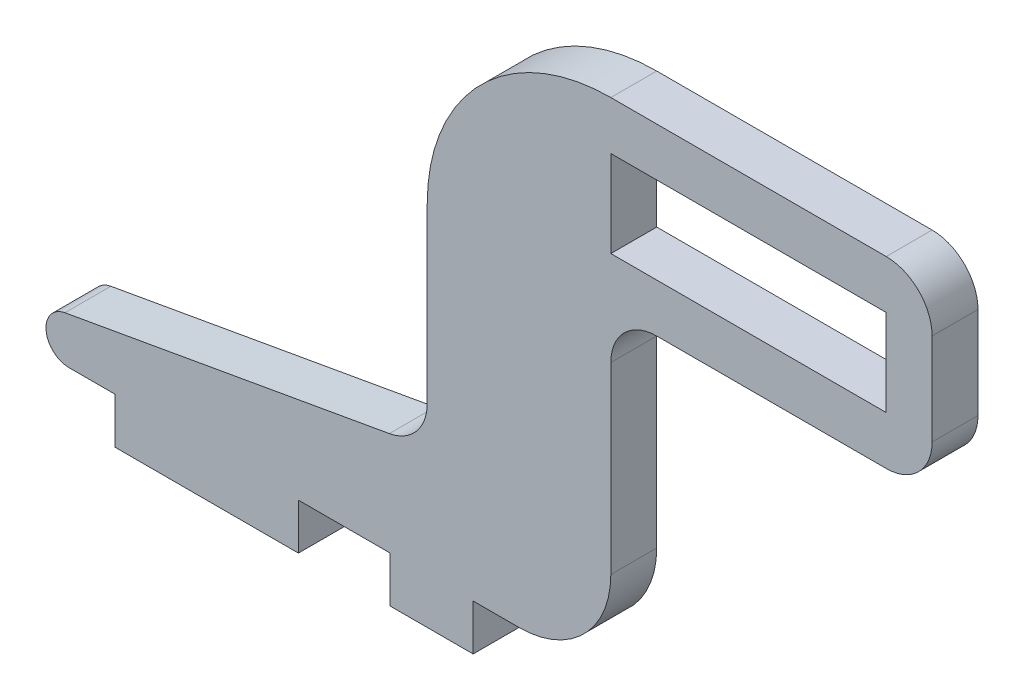
ISO-10303-21;
HEADER;
FILE_DESCRIPTION(('STEP AP214'),'2;1');
FILE_NAME('part.step','',(''),(''),'','','');
FILE_SCHEMA(('AUTOMOTIVE_DESIGN { 1 0 10303 214 1 1 1 1 }'));
ENDSEC;
DATA;
#1=APPLICATION_CONTEXT('core data for automotive mechanical design processes');
#2=APPLICATION_PROTOCOL_DEFINITION('international standard','automotive_design',2000,#1);
#3=PRODUCT_CONTEXT('',#1,'mechanical');
#4=PRODUCT('Part','Part','',(#3));
#5=PRODUCT_RELATED_PRODUCT_CATEGORY('part','',(#4));
#6=PRODUCT_DEFINITION_FORMATION('','',#4);
#7=PRODUCT_DEFINITION_CONTEXT('part definition',#1,'design');
#8=PRODUCT_DEFINITION('design','',#6,#7);
#9=PRODUCT_DEFINITION_SHAPE('','',#8);
#10=(LENGTH_UNIT() NAMED_UNIT(*) SI_UNIT(.MILLI.,.METRE.));
#11=(NAMED_UNIT(*) PLANE_ANGLE_UNIT() SI_UNIT($,.RADIAN.));
#12=(NAMED_UNIT(*) SI_UNIT($,.STERADIAN.) SOLID_ANGLE_UNIT());
#13=UNCERTAINTY_MEASURE_WITH_UNIT(LENGTH_MEASURE(1.E-05),#10,'distance_accuracy_value','');
#14=(GEOMETRIC_REPRESENTATION_CONTEXT(3) GLOBAL_UNCERTAINTY_ASSIGNED_CONTEXT((#13)) GLOBAL_UNIT_ASSIGNED_CONTEXT((#10,
#11,#12)) REPRESENTATION_CONTEXT('',''));
#15=CARTESIAN_POINT('',(0.,0.,0.));
#16=DIRECTION('',(0.,0.,1.));
#17=DIRECTION('',(1.,0.,0.));
#18=AXIS2_PLACEMENT_3D('',#15,#16,#17);
#19=CARTESIAN_POINT('',(15.2621733626374,9.525,3.175));
#20=DIRECTION('',(0.,0.,1.));
#21=DIRECTION('',(1.,0.,0.));
#22=AXIS2_PLACEMENT_3D('',#19,#20,#21);
#23=PLANE('',#22);
#24=DIRECTION('',(0.,1.,0.));
#25=VECTOR('',#24,1.);
#26=CARTESIAN_POINT('',(43.8371733626374,25.4,3.175));
#27=LINE('',#26,#25);
#28=CARTESIAN_POINT('',(43.8371733626374,28.575,3.175));
#29=VERTEX_POINT('',#28);
#30=CARTESIAN_POINT('',(43.8371733626374,34.925,3.175));
#31=VERTEX_POINT('',#30);
#32=EDGE_CURVE('E271',#29,#31,#27,.T.);
#33=ORIENTED_EDGE('',*,*,#32,.T.);
#34=CARTESIAN_POINT('',(40.6621733626374,34.925,3.175));
#35=DIRECTION('',(0.,0.,1.));
#36=DIRECTION('',(1.,0.,0.));
#37=AXIS2_PLACEMENT_3D('',#34,#35,#36);
#38=CIRCLE('',#37,3.175);
#39=CARTESIAN_POINT('',(40.6621733626374,38.1,3.175));
#40=VERTEX_POINT('',#39);
#41=EDGE_CURVE('E41',#31,#40,#38,.T.);
#42=ORIENTED_EDGE('',*,*,#41,.T.);
#43=DIRECTION('',(-1.,0.,0.));
#44=VECTOR('',#43,1.);
#45=CARTESIAN_POINT('',(43.8371733626374,38.1,3.175));
#46=LINE('',#45,#44);
#47=CARTESIAN_POINT('',(21.6121733626374,38.1,3.175));
#48=VERTEX_POINT('',#47);
#49=EDGE_CURVE('E273',#40,#48,#46,.T.);
#50=ORIENTED_EDGE('',*,*,#49,.T.);
#51=CARTESIAN_POINT('',(21.6121733626374,25.4,3.175));
#52=DIRECTION('',(0.,0.,1.));
#53=DIRECTION('',(1.,0.,0.));
#54=AXIS2_PLACEMENT_3D('',#51,#52,#53);
#55=CIRCLE('',#54,12.7);
#56=CARTESIAN_POINT('',(8.91217336263738,25.4,3.175));
#57=VERTEX_POINT('',#56);
#58=EDGE_CURVE('E275',#48,#57,#55,.T.);
#59=ORIENTED_EDGE('',*,*,#58,.T.);
#60=DIRECTION('',(0.,-1.,0.));
#61=VECTOR('',#60,1.);
#62=CARTESIAN_POINT('',(8.91217336263738,10.7720989469193,3.175));
#63=LINE('',#62,#61);
#64=CARTESIAN_POINT('',(8.91217336263738,13.4334196691304,3.175));
#65=VERTEX_POINT('',#64);
#66=EDGE_CURVE('E277',#57,#65,#63,.T.);
#67=ORIENTED_EDGE('',*,*,#66,.T.);
#68=CARTESIAN_POINT('',(5.73717336263738,13.4334196691304,3.175));
#69=DIRECTION('',(0.,0.,1.));
#70=DIRECTION('',(1.,0.,0.));
#71=AXIS2_PLACEMENT_3D('',#68,#69,#70);
#72=CIRCLE('',#71,3.175);
#73=CARTESIAN_POINT('',(6.29176756022104,10.3072318507154,3.175));
#74=VERTEX_POINT('',#73);
#75=EDGE_CURVE('E385',#65,#74,#72,.F.);
#76=ORIENTED_EDGE('',*,*,#75,.T.);
#77=DIRECTION('',(-0.984626084540168,-0.174675337821624,0.));
#78=VECTOR('',#77,1.);
#79=CARTESIAN_POINT('',(8.91217336263738,10.7720989469193,3.175));
#80=LINE('',#79,#78);
#81=CARTESIAN_POINT('',(-16.1522970987918,6.32559390920752,3.175));
#82=VERTEX_POINT('',#81);
#83=EDGE_CURVE('E280',#74,#82,#80,.T.);
#84=ORIENTED_EDGE('',*,*,#83,.T.);
#85=CARTESIAN_POINT('',(-15.875,4.7625,3.175));
#86=DIRECTION('',(0.,0.,1.));
#87=DIRECTION('',(1.,0.,0.));
#88=AXIS2_PLACEMENT_3D('',#85,#86,#87);
#89=CIRCLE('',#88,1.5875);
#90=CARTESIAN_POINT('',(-15.875,3.175,3.175));
#91=VERTEX_POINT('',#90);
#92=EDGE_CURVE('E282',#82,#91,#89,.T.);
#93=ORIENTED_EDGE('',*,*,#92,.T.);
#94=DIRECTION('',(1.,0.,0.));
#95=VECTOR('',#94,1.);
#96=CARTESIAN_POINT('',(-12.7,3.175,3.175));
#97=LINE('',#96,#95);
#98=CARTESIAN_POINT('',(-12.7,3.175,3.175));
#99=VERTEX_POINT('',#98);
#100=EDGE_CURVE('E284',#91,#99,#97,.T.);
#101=ORIENTED_EDGE('',*,*,#100,.T.);
#102=DIRECTION('',(0.,-1.,0.));
#103=VECTOR('',#102,1.);
#104=CARTESIAN_POINT('',(-12.7,0.,3.175));
#105=LINE('',#104,#103);
#106=CARTESIAN_POINT('',(-12.7,0.,3.175));
#107=VERTEX_POINT('',#106);
#108=EDGE_CURVE('E286',#99,#107,#105,.T.);
#109=ORIENTED_EDGE('',*,*,#108,.T.);
#110=DIRECTION('',(1.,0.,0.));
#111=VECTOR('',#110,1.);
#112=CARTESIAN_POINT('',(0.,0.,3.175));
#113=LINE('',#112,#111);
#114=CARTESIAN_POINT('',(0.,0.,3.175));
#115=VERTEX_POINT('',#114);
#116=EDGE_CURVE('E288',#107,#115,#113,.T.);
#117=ORIENTED_EDGE('',*,*,#116,.T.);
#118=DIRECTION('',(0.,1.,0.));
#119=VECTOR('',#118,1.);
#120=CARTESIAN_POINT('',(0.,0.,3.175));
#121=LINE('',#120,#119);
#122=CARTESIAN_POINT('',(0.,3.175,3.175));
#123=VERTEX_POINT('',#122);
#124=EDGE_CURVE('E250',#115,#123,#121,.T.);
#125=ORIENTED_EDGE('',*,*,#124,.T.);
#126=DIRECTION('',(1.,0.,0.));
#127=VECTOR('',#126,1.);
#128=CARTESIAN_POINT('',(0.,3.175,3.175));
#129=LINE('',#128,#127);
#130=CARTESIAN_POINT('',(6.35,3.175,3.175));
#131=VERTEX_POINT('',#130);
#132=EDGE_CURVE('E253',#123,#131,#129,.T.);
#133=ORIENTED_EDGE('',*,*,#132,.T.);
#134=DIRECTION('',(0.,-1.,0.));
#135=VECTOR('',#134,1.);
#136=CARTESIAN_POINT('',(6.35,3.175,3.175));
#137=LINE('',#136,#135);
#138=CARTESIAN_POINT('',(6.35,0.,3.175));
#139=VERTEX_POINT('',#138);
#140=EDGE_CURVE('E256',#131,#139,#137,.T.);
#141=ORIENTED_EDGE('',*,*,#140,.T.);
#142=DIRECTION('',(1.,0.,0.));
#143=VECTOR('',#142,1.);
#144=CARTESIAN_POINT('',(6.35,0.,3.175));
#145=LINE('',#144,#143);
#146=CARTESIAN_POINT('',(12.0871733626374,0.,3.175));
#147=VERTEX_POINT('',#146);
#148=EDGE_CURVE('E258',#139,#147,#145,.T.);
#149=ORIENTED_EDGE('',*,*,#148,.T.);
#150=DIRECTION('',(0.,1.,0.));
#151=VECTOR('',#150,1.);
#152=CARTESIAN_POINT('',(12.0871733626374,3.175,3.175));
#153=LINE('',#152,#151);
#154=CARTESIAN_POINT('',(12.0871733626374,3.175,3.175));
#155=VERTEX_POINT('',#154);
#156=EDGE_CURVE('E260',#147,#155,#153,.T.);
#157=ORIENTED_EDGE('',*,*,#156,.T.);
#158=DIRECTION('',(1.,0.,0.));
#159=VECTOR('',#158,1.);
#160=CARTESIAN_POINT('',(12.0871733626374,3.175,3.175));
#161=LINE('',#160,#159);
#162=CARTESIAN_POINT('',(15.2621733626374,3.175,3.175));
#163=VERTEX_POINT('',#162);
#164=EDGE_CURVE('E262',#155,#163,#161,.T.);
#165=ORIENTED_EDGE('',*,*,#164,.T.);
#166=CARTESIAN_POINT('',(15.2621733626374,9.525,3.175));
#167=DIRECTION('',(0.,0.,1.));
#168=DIRECTION('',(1.,0.,0.));
#169=AXIS2_PLACEMENT_3D('',#166,#167,#168);
#170=CIRCLE('',#169,6.35);
#171=CARTESIAN_POINT('',(21.6121733626374,9.525,3.175));
#172=VERTEX_POINT('',#171);
#173=EDGE_CURVE('E264',#163,#172,#170,.T.);
#174=ORIENTED_EDGE('',*,*,#173,.T.);
#175=DIRECTION('',(0.,1.,0.));
#176=VECTOR('',#175,1.);
#177=CARTESIAN_POINT('',(21.6121733626374,9.525,3.175));
#178=LINE('',#177,#176);
#179=CARTESIAN_POINT('',(21.6121733626374,22.225,3.175));
#180=VERTEX_POINT('',#179);
#181=EDGE_CURVE('E266',#172,#180,#178,.T.);
#182=ORIENTED_EDGE('',*,*,#181,.T.);
#183=CARTESIAN_POINT('',(24.7871733626374,22.225,3.175));
#184=DIRECTION('',(0.,0.,1.));
#185=DIRECTION('',(1.,0.,0.));
#186=AXIS2_PLACEMENT_3D('',#183,#184,#185);
#187=CIRCLE('',#186,3.175);
#188=CARTESIAN_POINT('',(24.7871733626374,25.4,3.175));
#189=VERTEX_POINT('',#188);
#190=EDGE_CURVE('E381',#180,#189,#187,.F.);
#191=ORIENTED_EDGE('',*,*,#190,.T.);
#192=DIRECTION('',(1.,0.,0.));
#193=VECTOR('',#192,1.);
#194=CARTESIAN_POINT('',(21.6121733626374,25.4,3.175));
#195=LINE('',#194,#193);
#196=CARTESIAN_POINT('',(40.6621733626374,25.4,3.175));
#197=VERTEX_POINT('',#196);
#198=EDGE_CURVE('E269',#189,#197,#195,.T.);
#199=ORIENTED_EDGE('',*,*,#198,.T.);
#200=CARTESIAN_POINT('',(40.6621733626374,28.575,3.175));
#201=DIRECTION('',(0.,0.,1.));
#202=DIRECTION('',(1.,0.,0.));
#203=AXIS2_PLACEMENT_3D('',#200,#201,#202);
#204=CIRCLE('',#203,3.175);
#205=EDGE_CURVE('E398',#197,#29,#204,.T.);
#206=ORIENTED_EDGE('',*,*,#205,.T.);
#207=EDGE_LOOP('',(#33,#42,#50,#59,#67,#76,#84,#93,#101,#109,#117,#125,#133,#141,#149,#157,#165,
#174,#182,#191,#199,#206));
#208=FACE_BOUND('',#207,.T.);
#209=DIRECTION('',(1.,0.,0.));
#210=VECTOR('',#209,1.);
#211=CARTESIAN_POINT('',(40.6621733626374,28.7528,3.175));
#212=LINE('',#211,#210);
#213=CARTESIAN_POINT('',(21.6121733626374,28.7528,3.175));
#214=VERTEX_POINT('',#213);
#215=CARTESIAN_POINT('',(40.6621733626374,28.7528,3.175));
#216=VERTEX_POINT('',#215);
#217=EDGE_CURVE('E219',#214,#216,#212,.T.);
#218=ORIENTED_EDGE('',*,*,#217,.F.);
#219=DIRECTION('',(0.,-1.,0.));
#220=VECTOR('',#219,1.);
#221=CARTESIAN_POINT('',(21.6121733626374,28.7528,3.175));
#222=LINE('',#221,#220);
#223=CARTESIAN_POINT('',(21.6121733626374,34.7472,3.175));
#224=VERTEX_POINT('',#223);
#225=EDGE_CURVE('E209',#224,#214,#222,.T.);
#226=ORIENTED_EDGE('',*,*,#225,.F.);
#227=DIRECTION('',(-1.,0.,0.));
#228=VECTOR('',#227,1.);
#229=CARTESIAN_POINT('',(40.6621733626374,34.7472,3.175));
#230=LINE('',#229,#228);
#231=CARTESIAN_POINT('',(40.6621733626374,34.7472,3.175));
#232=VERTEX_POINT('',#231);
#233=EDGE_CURVE('E234',#232,#224,#230,.T.);
#234=ORIENTED_EDGE('',*,*,#233,.F.);
#235=DIRECTION('',(0.,1.,0.));
#236=VECTOR('',#235,1.);
#237=CARTESIAN_POINT('',(40.6621733626374,28.7528,3.175));
#238=LINE('',#237,#236);
#239=EDGE_CURVE('E232',#216,#232,#238,.T.);
#240=ORIENTED_EDGE('',*,*,#239,.F.);
#241=EDGE_LOOP('',(#218,#226,#234,#240));
#242=FACE_BOUND('',#241,.T.);
#243=ADVANCED_FACE('F33',(#208,#242),#23,.T.);
#244=CARTESIAN_POINT('',(15.2621733626374,9.525,0.));
#245=DIRECTION('',(0.,0.,1.));
#246=DIRECTION('',(1.,0.,0.));
#247=AXIS2_PLACEMENT_3D('',#244,#245,#246);
#248=PLANE('',#247);
#249=DIRECTION('',(-1.,0.,0.));
#250=VECTOR('',#249,1.);
#251=CARTESIAN_POINT('',(43.8371733626374,38.1,0.));
#252=LINE('',#251,#250);
#253=CARTESIAN_POINT('',(40.6621733626374,38.1,0.));
#254=VERTEX_POINT('',#253);
#255=CARTESIAN_POINT('',(21.6121733626374,38.1,0.));
#256=VERTEX_POINT('',#255);
#257=EDGE_CURVE('E312',#254,#256,#252,.T.);
#258=ORIENTED_EDGE('',*,*,#257,.F.);
#259=CARTESIAN_POINT('',(40.6621733626374,34.925,0.));
#260=DIRECTION('',(0.,0.,1.));
#261=DIRECTION('',(1.,0.,0.));
#262=AXIS2_PLACEMENT_3D('',#259,#260,#261);
#263=CIRCLE('',#262,3.175);
#264=CARTESIAN_POINT('',(43.8371733626374,34.925,0.));
#265=VERTEX_POINT('',#264);
#266=EDGE_CURVE('E392',#254,#265,#263,.F.);
#267=ORIENTED_EDGE('',*,*,#266,.T.);
#268=DIRECTION('',(0.,1.,0.));
#269=VECTOR('',#268,1.);
#270=CARTESIAN_POINT('',(43.8371733626374,25.4,0.));
#271=LINE('',#270,#269);
#272=CARTESIAN_POINT('',(43.8371733626374,28.575,0.));
#273=VERTEX_POINT('',#272);
#274=EDGE_CURVE('E310',#273,#265,#271,.T.);
#275=ORIENTED_EDGE('',*,*,#274,.F.);
#276=CARTESIAN_POINT('',(40.6621733626374,28.575,0.));
#277=DIRECTION('',(0.,0.,1.));
#278=DIRECTION('',(1.,0.,0.));
#279=AXIS2_PLACEMENT_3D('',#276,#277,#278);
#280=CIRCLE('',#279,3.175);
#281=CARTESIAN_POINT('',(40.6621733626374,25.4,0.));
#282=VERTEX_POINT('',#281);
#283=EDGE_CURVE('E390',#273,#282,#280,.F.);
#284=ORIENTED_EDGE('',*,*,#283,.T.);
#285=DIRECTION('',(1.,0.,0.));
#286=VECTOR('',#285,1.);
#287=CARTESIAN_POINT('',(21.6121733626374,25.4,0.));
#288=LINE('',#287,#286);
#289=CARTESIAN_POINT('',(24.7871733626374,25.4,0.));
#290=VERTEX_POINT('',#289);
#291=EDGE_CURVE('E308',#290,#282,#288,.T.);
#292=ORIENTED_EDGE('',*,*,#291,.F.);
#293=CARTESIAN_POINT('',(24.7871733626374,22.225,0.));
#294=DIRECTION('',(0.,0.,1.));
#295=DIRECTION('',(1.,0.,0.));
#296=AXIS2_PLACEMENT_3D('',#293,#294,#295);
#297=CIRCLE('',#296,3.175);
#298=CARTESIAN_POINT('',(21.6121733626374,22.225,0.));
#299=VERTEX_POINT('',#298);
#300=EDGE_CURVE('E379',#290,#299,#297,.T.);
#301=ORIENTED_EDGE('',*,*,#300,.T.);
#302=DIRECTION('',(0.,1.,0.));
#303=VECTOR('',#302,1.);
#304=CARTESIAN_POINT('',(21.6121733626374,9.525,0.));
#305=LINE('',#304,#303);
#306=CARTESIAN_POINT('',(21.6121733626374,9.525,0.));
#307=VERTEX_POINT('',#306);
#308=EDGE_CURVE('E305',#307,#299,#305,.T.);
#309=ORIENTED_EDGE('',*,*,#308,.F.);
#310=CARTESIAN_POINT('',(15.2621733626374,9.525,0.));
#311=DIRECTION('',(0.,0.,1.));
#312=DIRECTION('',(1.,0.,0.));
#313=AXIS2_PLACEMENT_3D('',#310,#311,#312);
#314=CIRCLE('',#313,6.35);
#315=CARTESIAN_POINT('',(15.2621733626374,3.175,0.));
#316=VERTEX_POINT('',#315);
#317=EDGE_CURVE('E303',#316,#307,#314,.T.);
#318=ORIENTED_EDGE('',*,*,#317,.F.);
#319=DIRECTION('',(1.,0.,0.));
#320=VECTOR('',#319,1.);
#321=CARTESIAN_POINT('',(12.0871733626374,3.175,0.));
#322=LINE('',#321,#320);
#323=CARTESIAN_POINT('',(12.0871733626374,3.175,0.));
#324=VERTEX_POINT('',#323);
#325=EDGE_CURVE('E301',#324,#316,#322,.T.);
#326=ORIENTED_EDGE('',*,*,#325,.F.);
#327=DIRECTION('',(0.,1.,0.));
#328=VECTOR('',#327,1.);
#329=CARTESIAN_POINT('',(12.0871733626374,3.175,0.));
#330=LINE('',#329,#328);
#331=CARTESIAN_POINT('',(12.0871733626374,0.,0.));
#332=VERTEX_POINT('',#331);
#333=EDGE_CURVE('E299',#332,#324,#330,.T.);
#334=ORIENTED_EDGE('',*,*,#333,.F.);
#335=DIRECTION('',(1.,0.,0.));
#336=VECTOR('',#335,1.);
#337=CARTESIAN_POINT('',(6.35,0.,0.));
#338=LINE('',#337,#336);
#339=CARTESIAN_POINT('',(6.35,0.,0.));
#340=VERTEX_POINT('',#339);
#341=EDGE_CURVE('E297',#340,#332,#338,.T.);
#342=ORIENTED_EDGE('',*,*,#341,.F.);
#343=DIRECTION('',(0.,-1.,0.));
#344=VECTOR('',#343,1.);
#345=CARTESIAN_POINT('',(6.35,3.175,0.));
#346=LINE('',#345,#344);
#347=CARTESIAN_POINT('',(6.35,3.175,0.));
#348=VERTEX_POINT('',#347);
#349=EDGE_CURVE('E295',#348,#340,#346,.T.);
#350=ORIENTED_EDGE('',*,*,#349,.F.);
#351=DIRECTION('',(1.,0.,0.));
#352=VECTOR('',#351,1.);
#353=CARTESIAN_POINT('',(0.,3.175,0.));
#354=LINE('',#353,#352);
#355=CARTESIAN_POINT('',(0.,3.175,0.));
#356=VERTEX_POINT('',#355);
#357=EDGE_CURVE('E293',#356,#348,#354,.T.);
#358=ORIENTED_EDGE('',*,*,#357,.F.);
#359=DIRECTION('',(0.,1.,0.));
#360=VECTOR('',#359,1.);
#361=CARTESIAN_POINT('',(0.,0.,0.));
#362=LINE('',#361,#360);
#363=CARTESIAN_POINT('',(0.,0.,0.));
#364=VERTEX_POINT('',#363);
#365=EDGE_CURVE('E227',#364,#356,#362,.T.);
#366=ORIENTED_EDGE('',*,*,#365,.F.);
#367=DIRECTION('',(1.,0.,0.));
#368=VECTOR('',#367,1.);
#369=CARTESIAN_POINT('',(0.,0.,0.));
#370=LINE('',#369,#368);
#371=CARTESIAN_POINT('',(-12.7,0.,0.));
#372=VERTEX_POINT('',#371);
#373=EDGE_CURVE('E254',#372,#364,#370,.T.);
#374=ORIENTED_EDGE('',*,*,#373,.F.);
#375=DIRECTION('',(0.,-1.,0.));
#376=VECTOR('',#375,1.);
#377=CARTESIAN_POINT('',(-12.7,0.,0.));
#378=LINE('',#377,#376);
#379=CARTESIAN_POINT('',(-12.7,3.175,0.));
#380=VERTEX_POINT('',#379);
#381=EDGE_CURVE('E325',#380,#372,#378,.T.);
#382=ORIENTED_EDGE('',*,*,#381,.F.);
#383=DIRECTION('',(1.,0.,0.));
#384=VECTOR('',#383,1.);
#385=CARTESIAN_POINT('',(-12.7,3.175,0.));
#386=LINE('',#385,#384);
#387=CARTESIAN_POINT('',(-15.875,3.175,0.));
#388=VERTEX_POINT('',#387);
#389=EDGE_CURVE('E323',#388,#380,#386,.T.);
#390=ORIENTED_EDGE('',*,*,#389,.F.);
#391=CARTESIAN_POINT('',(-15.875,4.7625,0.));
#392=DIRECTION('',(0.,0.,1.));
#393=DIRECTION('',(1.,0.,0.));
#394=AXIS2_PLACEMENT_3D('',#391,#392,#393);
#395=CIRCLE('',#394,1.5875);
#396=CARTESIAN_POINT('',(-16.1522970987918,6.32559390920752,0.));
#397=VERTEX_POINT('',#396);
#398=EDGE_CURVE('E321',#397,#388,#395,.T.);
#399=ORIENTED_EDGE('',*,*,#398,.F.);
#400=DIRECTION('',(-0.984626084540168,-0.174675337821624,0.));
#401=VECTOR('',#400,1.);
#402=CARTESIAN_POINT('',(8.91217336263738,10.7720989469193,0.));
#403=LINE('',#402,#401);
#404=CARTESIAN_POINT('',(6.29176756022104,10.3072318507154,0.));
#405=VERTEX_POINT('',#404);
#406=EDGE_CURVE('E319',#405,#397,#403,.T.);
#407=ORIENTED_EDGE('',*,*,#406,.F.);
#408=CARTESIAN_POINT('',(5.73717336263738,13.4334196691304,0.));
#409=DIRECTION('',(0.,0.,1.));
#410=DIRECTION('',(1.,0.,0.));
#411=AXIS2_PLACEMENT_3D('',#408,#409,#410);
#412=CIRCLE('',#411,3.175);
#413=CARTESIAN_POINT('',(8.91217336263738,13.4334196691304,0.));
#414=VERTEX_POINT('',#413);
#415=EDGE_CURVE('E383',#405,#414,#412,.T.);
#416=ORIENTED_EDGE('',*,*,#415,.T.);
#417=DIRECTION('',(0.,-1.,0.));
#418=VECTOR('',#417,1.);
#419=CARTESIAN_POINT('',(8.91217336263738,10.7720989469193,0.));
#420=LINE('',#419,#418);
#421=CARTESIAN_POINT('',(8.91217336263738,25.4,0.));
#422=VERTEX_POINT('',#421);
#423=EDGE_CURVE('E316',#422,#414,#420,.T.);
#424=ORIENTED_EDGE('',*,*,#423,.F.);
#425=CARTESIAN_POINT('',(21.6121733626374,25.4,0.));
#426=DIRECTION('',(0.,0.,1.));
#427=DIRECTION('',(1.,0.,0.));
#428=AXIS2_PLACEMENT_3D('',#425,#426,#427);
#429=CIRCLE('',#428,12.7);
#430=EDGE_CURVE('E314',#256,#422,#429,.T.);
#431=ORIENTED_EDGE('',*,*,#430,.F.);
#432=EDGE_LOOP('',(#258,#267,#275,#284,#292,#301,#309,#318,#326,#334,#342,#350,#358,#366,#374,
#382,#390,#399,#407,#416,#424,#431));
#433=FACE_BOUND('',#432,.T.);
#434=DIRECTION('',(0.,-1.,0.));
#435=VECTOR('',#434,1.);
#436=CARTESIAN_POINT('',(21.6121733626374,28.7528,0.));
#437=LINE('',#436,#435);
#438=CARTESIAN_POINT('',(21.6121733626374,34.7472,0.));
#439=VERTEX_POINT('',#438);
#440=CARTESIAN_POINT('',(21.6121733626374,28.7528,0.));
#441=VERTEX_POINT('',#440);
#442=EDGE_CURVE('E238',#439,#441,#437,.T.);
#443=ORIENTED_EDGE('',*,*,#442,.T.);
#444=DIRECTION('',(1.,0.,0.));
#445=VECTOR('',#444,1.);
#446=CARTESIAN_POINT('',(40.6621733626374,28.7528,0.));
#447=LINE('',#446,#445);
#448=CARTESIAN_POINT('',(40.6621733626374,28.7528,0.));
#449=VERTEX_POINT('',#448);
#450=EDGE_CURVE('E226',#441,#449,#447,.T.);
#451=ORIENTED_EDGE('',*,*,#450,.T.);
#452=DIRECTION('',(0.,1.,0.));
#453=VECTOR('',#452,1.);
#454=CARTESIAN_POINT('',(40.6621733626374,28.7528,0.));
#455=LINE('',#454,#453);
#456=CARTESIAN_POINT('',(40.6621733626374,34.7472,0.));
#457=VERTEX_POINT('',#456);
#458=EDGE_CURVE('E241',#449,#457,#455,.T.);
#459=ORIENTED_EDGE('',*,*,#458,.T.);
#460=DIRECTION('',(-1.,0.,0.));
#461=VECTOR('',#460,1.);
#462=CARTESIAN_POINT('',(40.6621733626374,34.7472,0.));
#463=LINE('',#462,#461);
#464=EDGE_CURVE('E220',#457,#439,#463,.T.);
#465=ORIENTED_EDGE('',*,*,#464,.T.);
#466=EDGE_LOOP('',(#443,#451,#459,#465));
#467=FACE_BOUND('',#466,.T.);
#468=ADVANCED_FACE('F412',(#433,#467),#248,.F.);
#469=CARTESIAN_POINT('',(0.,0.,3.175));
#470=DIRECTION('',(-1.,0.,0.));
#471=DIRECTION('',(0.,-1.,0.));
#472=AXIS2_PLACEMENT_3D('',#469,#470,#471);
#473=PLANE('',#472);
#474=ORIENTED_EDGE('',*,*,#365,.T.);
#475=DIRECTION('',(0.,0.,-1.));
#476=VECTOR('',#475,1.);
#477=CARTESIAN_POINT('',(0.,3.175,3.175));
#478=LINE('',#477,#476);
#479=EDGE_CURVE('E366',#123,#356,#478,.T.);
#480=ORIENTED_EDGE('',*,*,#479,.F.);
#481=ORIENTED_EDGE('',*,*,#124,.F.);
#482=DIRECTION('',(0.,0.,-1.));
#483=VECTOR('',#482,1.);
#484=CARTESIAN_POINT('',(0.,0.,3.175));
#485=LINE('',#484,#483);
#486=EDGE_CURVE('E290',#115,#364,#485,.T.);
#487=ORIENTED_EDGE('',*,*,#486,.T.);
#488=EDGE_LOOP('',(#474,#480,#481,#487));
#489=FACE_BOUND('',#488,.T.);
#490=ADVANCED_FACE('F462',(#489),#473,.F.);
#491=CARTESIAN_POINT('',(0.,3.175,3.175));
#492=DIRECTION('',(0.,1.,0.));
#493=DIRECTION('',(-1.,0.,0.));
#494=AXIS2_PLACEMENT_3D('',#491,#492,#493);
#495=PLANE('',#494);
#496=ORIENTED_EDGE('',*,*,#357,.T.);
#497=DIRECTION('',(0.,0.,-1.));
#498=VECTOR('',#497,1.);
#499=CARTESIAN_POINT('',(6.35,3.175,3.175));
#500=LINE('',#499,#498);
#501=EDGE_CURVE('E363',#131,#348,#500,.T.);
#502=ORIENTED_EDGE('',*,*,#501,.F.);
#503=ORIENTED_EDGE('',*,*,#132,.F.);
#504=ORIENTED_EDGE('',*,*,#479,.T.);
#505=EDGE_LOOP('',(#496,#502,#503,#504));
#506=FACE_BOUND('',#505,.T.);
#507=ADVANCED_FACE('F458',(#506),#495,.F.);
#508=CARTESIAN_POINT('',(6.35,3.175,3.175));
#509=DIRECTION('',(1.,0.,0.));
#510=DIRECTION('',(0.,0.,-1.));
#511=AXIS2_PLACEMENT_3D('',#508,#509,#510);
#512=PLANE('',#511);
#513=ORIENTED_EDGE('',*,*,#349,.T.);
#514=DIRECTION('',(0.,0.,-1.));
#515=VECTOR('',#514,1.);
#516=CARTESIAN_POINT('',(6.35,0.,3.175));
#517=LINE('',#516,#515);
#518=EDGE_CURVE('E360',#139,#340,#517,.T.);
#519=ORIENTED_EDGE('',*,*,#518,.F.);
#520=ORIENTED_EDGE('',*,*,#140,.F.);
#521=ORIENTED_EDGE('',*,*,#501,.T.);
#522=EDGE_LOOP('',(#513,#519,#520,#521));
#523=FACE_BOUND('',#522,.T.);
#524=ADVANCED_FACE('F454',(#523),#512,.F.);
#525=CARTESIAN_POINT('',(6.35,0.,3.175));
#526=DIRECTION('',(0.,1.,0.));
#527=DIRECTION('',(-1.,0.,0.));
#528=AXIS2_PLACEMENT_3D('',#525,#526,#527);
#529=PLANE('',#528);
#530=ORIENTED_EDGE('',*,*,#341,.T.);
#531=DIRECTION('',(0.,0.,-1.));
#532=VECTOR('',#531,1.);
#533=CARTESIAN_POINT('',(12.0871733626374,0.,3.175));
#534=LINE('',#533,#532);
#535=EDGE_CURVE('E357',#147,#332,#534,.T.);
#536=ORIENTED_EDGE('',*,*,#535,.F.);
#537=ORIENTED_EDGE('',*,*,#148,.F.);
#538=ORIENTED_EDGE('',*,*,#518,.T.);
#539=EDGE_LOOP('',(#530,#536,#537,#538));
#540=FACE_BOUND('',#539,.T.);
#541=ADVANCED_FACE('F449',(#540),#529,.F.);
#542=CARTESIAN_POINT('',(12.0871733626374,3.175,3.175));
#543=DIRECTION('',(-1.,0.,0.));
#544=DIRECTION('',(0.,0.,1.));
#545=AXIS2_PLACEMENT_3D('',#542,#543,#544);
#546=PLANE('',#545);
#547=ORIENTED_EDGE('',*,*,#333,.T.);
#548=DIRECTION('',(0.,0.,-1.));
#549=VECTOR('',#548,1.);
#550=CARTESIAN_POINT('',(12.0871733626374,3.175,3.175));
#551=LINE('',#550,#549);
#552=EDGE_CURVE('E354',#155,#324,#551,.T.);
#553=ORIENTED_EDGE('',*,*,#552,.F.);
#554=ORIENTED_EDGE('',*,*,#156,.F.);
#555=ORIENTED_EDGE('',*,*,#535,.T.);
#556=EDGE_LOOP('',(#547,#553,#554,#555));
#557=FACE_BOUND('',#556,.T.);
#558=ADVANCED_FACE('F445',(#557),#546,.F.);
#559=CARTESIAN_POINT('',(12.0871733626374,3.175,3.175));
#560=DIRECTION('',(0.,1.,0.));
#561=DIRECTION('',(0.,0.,1.));
#562=AXIS2_PLACEMENT_3D('',#559,#560,#561);
#563=PLANE('',#562);
#564=ORIENTED_EDGE('',*,*,#325,.T.);
#565=DIRECTION('',(0.,0.,-1.));
#566=VECTOR('',#565,1.);
#567=CARTESIAN_POINT('',(15.2621733626374,3.175,3.175));
#568=LINE('',#567,#566);
#569=EDGE_CURVE('E351',#163,#316,#568,.T.);
#570=ORIENTED_EDGE('',*,*,#569,.F.);
#571=ORIENTED_EDGE('',*,*,#164,.F.);
#572=ORIENTED_EDGE('',*,*,#552,.T.);
#573=EDGE_LOOP('',(#564,#570,#571,#572));
#574=FACE_BOUND('',#573,.T.);
#575=ADVANCED_FACE('F440',(#574),#563,.F.);
#576=CARTESIAN_POINT('',(15.2621733626374,9.525,3.175));
#577=DIRECTION('',(0.,0.,-1.));
#578=DIRECTION('',(-1.,0.,0.));
#579=AXIS2_PLACEMENT_3D('',#576,#577,#578);
#580=CYLINDRICAL_SURFACE('',#579,6.35);
#581=ORIENTED_EDGE('',*,*,#317,.T.);
#582=DIRECTION('',(0.,0.,-1.));
#583=VECTOR('',#582,1.);
#584=CARTESIAN_POINT('',(21.6121733626374,9.525,3.175));
#585=LINE('',#584,#583);
#586=EDGE_CURVE('E348',#172,#307,#585,.T.);
#587=ORIENTED_EDGE('',*,*,#586,.F.);
#588=ORIENTED_EDGE('',*,*,#173,.F.);
#589=ORIENTED_EDGE('',*,*,#569,.T.);
#590=EDGE_LOOP('',(#581,#587,#588,#589));
#591=FACE_BOUND('',#590,.T.);
#592=ADVANCED_FACE('F434',(#591),#580,.T.);
#593=CARTESIAN_POINT('',(21.6121733626374,9.525,3.175));
#594=DIRECTION('',(-1.,0.,0.));
#595=DIRECTION('',(0.,0.,1.));
#596=AXIS2_PLACEMENT_3D('',#593,#594,#595);
#597=PLANE('',#596);
#598=ORIENTED_EDGE('',*,*,#308,.T.);
#599=DIRECTION('',(0.,0.,-1.));
#600=VECTOR('',#599,1.);
#601=CARTESIAN_POINT('',(21.6121733626374,22.225,3.175));
#602=LINE('',#601,#600);
#603=EDGE_CURVE('E372',#299,#180,#602,.F.);
#604=ORIENTED_EDGE('',*,*,#603,.T.);
#605=ORIENTED_EDGE('',*,*,#181,.F.);
#606=ORIENTED_EDGE('',*,*,#586,.T.);
#607=EDGE_LOOP('',(#598,#604,#605,#606));
#608=FACE_BOUND('',#607,.T.);
#609=ADVANCED_FACE('F429',(#608),#597,.F.);
#610=CARTESIAN_POINT('',(21.6121733626374,25.4,3.175));
#611=DIRECTION('',(0.,1.,0.));
#612=DIRECTION('',(0.,0.,1.));
#613=AXIS2_PLACEMENT_3D('',#610,#611,#612);
#614=PLANE('',#613);
#615=ORIENTED_EDGE('',*,*,#291,.T.);
#616=DIRECTION('',(0.,0.,-1.));
#617=VECTOR('',#616,1.);
#618=CARTESIAN_POINT('',(40.6621733626374,25.4,3.175));
#619=LINE('',#618,#617);
#620=EDGE_CURVE('E11',#282,#197,#619,.F.);
#621=ORIENTED_EDGE('',*,*,#620,.T.);
#622=ORIENTED_EDGE('',*,*,#198,.F.);
#623=DIRECTION('',(0.,0.,-1.));
#624=VECTOR('',#623,1.);
#625=CARTESIAN_POINT('',(24.7871733626374,25.4,0.));
#626=LINE('',#625,#624);
#627=EDGE_CURVE('E369',#189,#290,#626,.T.);
#628=ORIENTED_EDGE('',*,*,#627,.T.);
#629=EDGE_LOOP('',(#615,#621,#622,#628));
#630=FACE_BOUND('',#629,.T.);
#631=ADVANCED_FACE('F420',(#630),#614,.F.);
#632=CARTESIAN_POINT('',(43.8371733626374,25.4,3.175));
#633=DIRECTION('',(-1.,0.,0.));
#634=DIRECTION('',(0.,0.,1.));
#635=AXIS2_PLACEMENT_3D('',#632,#633,#634);
#636=PLANE('',#635);
#637=ORIENTED_EDGE('',*,*,#274,.T.);
#638=DIRECTION('',(0.,0.,-1.));
#639=VECTOR('',#638,1.);
#640=CARTESIAN_POINT('',(43.8371733626374,34.925,3.175));
#641=LINE('',#640,#639);
#642=EDGE_CURVE('E54',#265,#31,#641,.F.);
#643=ORIENTED_EDGE('',*,*,#642,.T.);
#644=ORIENTED_EDGE('',*,*,#32,.F.);
#645=DIRECTION('',(0.,0.,-1.));
#646=VECTOR('',#645,1.);
#647=CARTESIAN_POINT('',(43.8371733626374,28.575,3.175));
#648=LINE('',#647,#646);
#649=EDGE_CURVE('E394',#29,#273,#648,.T.);
#650=ORIENTED_EDGE('',*,*,#649,.T.);
#651=EDGE_LOOP('',(#637,#643,#644,#650));
#652=FACE_BOUND('',#651,.T.);
#653=ADVANCED_FACE('F415',(#652),#636,.F.);
#654=CARTESIAN_POINT('',(43.8371733626374,38.1,3.175));
#655=DIRECTION('',(0.,-1.,0.));
#656=DIRECTION('',(1.,0.,0.));
#657=AXIS2_PLACEMENT_3D('',#654,#655,#656);
#658=PLANE('',#657);
#659=ORIENTED_EDGE('',*,*,#49,.F.);
#660=DIRECTION('',(0.,0.,-1.));
#661=VECTOR('',#660,1.);
#662=CARTESIAN_POINT('',(40.6621733626374,38.1,3.175));
#663=LINE('',#662,#661);
#664=EDGE_CURVE('E387',#40,#254,#663,.T.);
#665=ORIENTED_EDGE('',*,*,#664,.T.);
#666=ORIENTED_EDGE('',*,*,#257,.T.);
#667=DIRECTION('',(0.,0.,-1.));
#668=VECTOR('',#667,1.);
#669=CARTESIAN_POINT('',(21.6121733626374,38.1,3.175));
#670=LINE('',#669,#668);
#671=EDGE_CURVE('E345',#48,#256,#670,.T.);
#672=ORIENTED_EDGE('',*,*,#671,.F.);
#673=EDGE_LOOP('',(#659,#665,#666,#672));
#674=FACE_BOUND('',#673,.T.);
#675=ADVANCED_FACE('F406',(#674),#658,.F.);
#676=CARTESIAN_POINT('',(21.6121733626374,25.4,3.175));
#677=DIRECTION('',(0.,0.,-1.));
#678=DIRECTION('',(-1.,0.,0.));
#679=AXIS2_PLACEMENT_3D('',#676,#677,#678);
#680=CYLINDRICAL_SURFACE('',#679,12.7);
#681=ORIENTED_EDGE('',*,*,#430,.T.);
#682=DIRECTION('',(0.,0.,-1.));
#683=VECTOR('',#682,1.);
#684=CARTESIAN_POINT('',(8.91217336263738,25.4,3.175));
#685=LINE('',#684,#683);
#686=EDGE_CURVE('E342',#57,#422,#685,.T.);
#687=ORIENTED_EDGE('',*,*,#686,.F.);
#688=ORIENTED_EDGE('',*,*,#58,.F.);
#689=ORIENTED_EDGE('',*,*,#671,.T.);
#690=EDGE_LOOP('',(#681,#687,#688,#689));
#691=FACE_BOUND('',#690,.T.);
#692=ADVANCED_FACE('F499',(#691),#680,.T.);
#693=CARTESIAN_POINT('',(8.91217336263738,10.7720989469193,3.175));
#694=DIRECTION('',(1.,0.,0.));
#695=DIRECTION('',(0.,1.,0.));
#696=AXIS2_PLACEMENT_3D('',#693,#694,#695);
#697=PLANE('',#696);
#698=ORIENTED_EDGE('',*,*,#423,.T.);
#699=DIRECTION('',(0.,0.,-1.));
#700=VECTOR('',#699,1.);
#701=CARTESIAN_POINT('',(8.91217336263738,13.4334196691304,3.175));
#702=LINE('',#701,#700);
#703=EDGE_CURVE('E377',#414,#65,#702,.F.);
#704=ORIENTED_EDGE('',*,*,#703,.T.);
#705=ORIENTED_EDGE('',*,*,#66,.F.);
#706=ORIENTED_EDGE('',*,*,#686,.T.);
#707=EDGE_LOOP('',(#698,#704,#705,#706));
#708=FACE_BOUND('',#707,.T.);
#709=ADVANCED_FACE('F495',(#708),#697,.F.);
#710=CARTESIAN_POINT('',(8.91217336263738,10.7720989469193,3.175));
#711=DIRECTION('',(0.174675337821624,-0.984626084540168,0.));
#712=DIRECTION('',(0.984626084540168,0.174675337821624,0.));
#713=AXIS2_PLACEMENT_3D('',#710,#711,#712);
#714=PLANE('',#713);
#715=ORIENTED_EDGE('',*,*,#83,.F.);
#716=DIRECTION('',(0.,0.,-1.));
#717=VECTOR('',#716,1.);
#718=CARTESIAN_POINT('',(6.29176756022104,10.3072318507154,0.));
#719=LINE('',#718,#717);
#720=EDGE_CURVE('E374',#74,#405,#719,.T.);
#721=ORIENTED_EDGE('',*,*,#720,.T.);
#722=ORIENTED_EDGE('',*,*,#406,.T.);
#723=DIRECTION('',(0.,0.,-1.));
#724=VECTOR('',#723,1.);
#725=CARTESIAN_POINT('',(-16.1522970987918,6.32559390920752,3.175));
#726=LINE('',#725,#724);
#727=EDGE_CURVE('E339',#82,#397,#726,.T.);
#728=ORIENTED_EDGE('',*,*,#727,.F.);
#729=EDGE_LOOP('',(#715,#721,#722,#728));
#730=FACE_BOUND('',#729,.T.);
#731=ADVANCED_FACE('F487',(#730),#714,.F.);
#732=CARTESIAN_POINT('',(-15.875,4.7625,3.175));
#733=DIRECTION('',(0.,0.,-1.));
#734=DIRECTION('',(-1.,0.,0.));
#735=AXIS2_PLACEMENT_3D('',#732,#733,#734);
#736=CYLINDRICAL_SURFACE('',#735,1.5875);
#737=ORIENTED_EDGE('',*,*,#398,.T.);
#738=DIRECTION('',(0.,0.,-1.));
#739=VECTOR('',#738,1.);
#740=CARTESIAN_POINT('',(-15.875,3.175,3.175));
#741=LINE('',#740,#739);
#742=EDGE_CURVE('E336',#91,#388,#741,.T.);
#743=ORIENTED_EDGE('',*,*,#742,.F.);
#744=ORIENTED_EDGE('',*,*,#92,.F.);
#745=ORIENTED_EDGE('',*,*,#727,.T.);
#746=EDGE_LOOP('',(#737,#743,#744,#745));
#747=FACE_BOUND('',#746,.T.);
#748=ADVANCED_FACE('F482',(#747),#736,.T.);
#749=CARTESIAN_POINT('',(-12.7,3.175,3.175));
#750=DIRECTION('',(0.,1.,0.));
#751=DIRECTION('',(-1.,0.,0.));
#752=AXIS2_PLACEMENT_3D('',#749,#750,#751);
#753=PLANE('',#752);
#754=ORIENTED_EDGE('',*,*,#389,.T.);
#755=DIRECTION('',(0.,0.,-1.));
#756=VECTOR('',#755,1.);
#757=CARTESIAN_POINT('',(-12.7,3.175,3.175));
#758=LINE('',#757,#756);
#759=EDGE_CURVE('E333',#99,#380,#758,.T.);
#760=ORIENTED_EDGE('',*,*,#759,.F.);
#761=ORIENTED_EDGE('',*,*,#100,.F.);
#762=ORIENTED_EDGE('',*,*,#742,.T.);
#763=EDGE_LOOP('',(#754,#760,#761,#762));
#764=FACE_BOUND('',#763,.T.);
#765=ADVANCED_FACE('F477',(#764),#753,.F.);
#766=CARTESIAN_POINT('',(-12.7,0.,3.175));
#767=DIRECTION('',(1.,0.,0.));
#768=DIRECTION('',(0.,0.,-1.));
#769=AXIS2_PLACEMENT_3D('',#766,#767,#768);
#770=PLANE('',#769);
#771=ORIENTED_EDGE('',*,*,#381,.T.);
#772=DIRECTION('',(0.,0.,-1.));
#773=VECTOR('',#772,1.);
#774=CARTESIAN_POINT('',(-12.7,0.,3.175));
#775=LINE('',#774,#773);
#776=EDGE_CURVE('E330',#107,#372,#775,.T.);
#777=ORIENTED_EDGE('',*,*,#776,.F.);
#778=ORIENTED_EDGE('',*,*,#108,.F.);
#779=ORIENTED_EDGE('',*,*,#759,.T.);
#780=EDGE_LOOP('',(#771,#777,#778,#779));
#781=FACE_BOUND('',#780,.T.);
#782=ADVANCED_FACE('F473',(#781),#770,.F.);
#783=CARTESIAN_POINT('',(0.,0.,3.175));
#784=DIRECTION('',(0.,1.,0.));
#785=DIRECTION('',(0.,0.,1.));
#786=AXIS2_PLACEMENT_3D('',#783,#784,#785);
#787=PLANE('',#786);
#788=ORIENTED_EDGE('',*,*,#373,.T.);
#789=ORIENTED_EDGE('',*,*,#486,.F.);
#790=ORIENTED_EDGE('',*,*,#116,.F.);
#791=ORIENTED_EDGE('',*,*,#776,.T.);
#792=EDGE_LOOP('',(#788,#789,#790,#791));
#793=FACE_BOUND('',#792,.T.);
#794=ADVANCED_FACE('F468',(#793),#787,.F.);
#795=CARTESIAN_POINT('',(21.6121733626374,28.7528,3.175));
#796=DIRECTION('',(1.,0.,0.));
#797=DIRECTION('',(0.,1.,0.));
#798=AXIS2_PLACEMENT_3D('',#795,#796,#797);
#799=PLANE('',#798);
#800=ORIENTED_EDGE('',*,*,#442,.F.);
#801=DIRECTION('',(0.,0.,-1.));
#802=VECTOR('',#801,1.);
#803=CARTESIAN_POINT('',(21.6121733626374,34.7472,3.175));
#804=LINE('',#803,#802);
#805=EDGE_CURVE('E215',#224,#439,#804,.T.);
#806=ORIENTED_EDGE('',*,*,#805,.F.);
#807=ORIENTED_EDGE('',*,*,#225,.T.);
#808=DIRECTION('',(0.,0.,-1.));
#809=VECTOR('',#808,1.);
#810=CARTESIAN_POINT('',(21.6121733626374,28.7528,3.175));
#811=LINE('',#810,#809);
#812=EDGE_CURVE('E212',#214,#441,#811,.T.);
#813=ORIENTED_EDGE('',*,*,#812,.T.);
#814=EDGE_LOOP('',(#800,#806,#807,#813));
#815=FACE_BOUND('',#814,.T.);
#816=ADVANCED_FACE('F211',(#815),#799,.T.);
#817=CARTESIAN_POINT('',(40.6621733626374,28.7528,3.175));
#818=DIRECTION('',(0.,1.,0.));
#819=DIRECTION('',(0.,0.,1.));
#820=AXIS2_PLACEMENT_3D('',#817,#818,#819);
#821=PLANE('',#820);
#822=ORIENTED_EDGE('',*,*,#450,.F.);
#823=ORIENTED_EDGE('',*,*,#812,.F.);
#824=ORIENTED_EDGE('',*,*,#217,.T.);
#825=DIRECTION('',(0.,0.,-1.));
#826=VECTOR('',#825,1.);
#827=CARTESIAN_POINT('',(40.6621733626374,28.7528,3.175));
#828=LINE('',#827,#826);
#829=EDGE_CURVE('E228',#216,#449,#828,.T.);
#830=ORIENTED_EDGE('',*,*,#829,.T.);
#831=EDGE_LOOP('',(#822,#823,#824,#830));
#832=FACE_BOUND('',#831,.T.);
#833=ADVANCED_FACE('F223',(#832),#821,.T.);
#834=CARTESIAN_POINT('',(40.6621733626374,28.7528,3.175));
#835=DIRECTION('',(-1.,0.,0.));
#836=DIRECTION('',(0.,0.,1.));
#837=AXIS2_PLACEMENT_3D('',#834,#835,#836);
#838=PLANE('',#837);
#839=ORIENTED_EDGE('',*,*,#458,.F.);
#840=ORIENTED_EDGE('',*,*,#829,.F.);
#841=ORIENTED_EDGE('',*,*,#239,.T.);
#842=DIRECTION('',(0.,0.,-1.));
#843=VECTOR('',#842,1.);
#844=CARTESIAN_POINT('',(40.6621733626374,34.7472,3.175));
#845=LINE('',#844,#843);
#846=EDGE_CURVE('E247',#232,#457,#845,.T.);
#847=ORIENTED_EDGE('',*,*,#846,.T.);
#848=EDGE_LOOP('',(#839,#840,#841,#847));
#849=FACE_BOUND('',#848,.T.);
#850=ADVANCED_FACE('F558',(#849),#838,.T.);
#851=CARTESIAN_POINT('',(40.6621733626374,34.7472,3.175));
#852=DIRECTION('',(0.,-1.,0.));
#853=DIRECTION('',(0.,0.,-1.));
#854=AXIS2_PLACEMENT_3D('',#851,#852,#853);
#855=PLANE('',#854);
#856=ORIENTED_EDGE('',*,*,#464,.F.);
#857=ORIENTED_EDGE('',*,*,#846,.F.);
#858=ORIENTED_EDGE('',*,*,#233,.T.);
#859=ORIENTED_EDGE('',*,*,#805,.T.);
#860=EDGE_LOOP('',(#856,#857,#858,#859));
#861=FACE_BOUND('',#860,.T.);
#862=ADVANCED_FACE('F564',(#861),#855,.T.);
#863=CARTESIAN_POINT('',(24.7871733626374,22.225,3.175));
#864=DIRECTION('',(0.,0.,1.));
#865=DIRECTION('',(1.,0.,0.));
#866=AXIS2_PLACEMENT_3D('',#863,#864,#865);
#867=CYLINDRICAL_SURFACE('',#866,3.175);
#868=ORIENTED_EDGE('',*,*,#190,.F.);
#869=ORIENTED_EDGE('',*,*,#603,.F.);
#870=ORIENTED_EDGE('',*,*,#300,.F.);
#871=ORIENTED_EDGE('',*,*,#627,.F.);
#872=EDGE_LOOP('',(#868,#869,#870,#871));
#873=FACE_BOUND('',#872,.T.);
#874=ADVANCED_FACE('F424',(#873),#867,.F.);
#875=CARTESIAN_POINT('',(5.73717336263738,13.4334196691304,3.175));
#876=DIRECTION('',(0.,0.,1.));
#877=DIRECTION('',(1.,0.,0.));
#878=AXIS2_PLACEMENT_3D('',#875,#876,#877);
#879=CYLINDRICAL_SURFACE('',#878,3.175);
#880=ORIENTED_EDGE('',*,*,#75,.F.);
#881=ORIENTED_EDGE('',*,*,#703,.F.);
#882=ORIENTED_EDGE('',*,*,#415,.F.);
#883=ORIENTED_EDGE('',*,*,#720,.F.);
#884=EDGE_LOOP('',(#880,#881,#882,#883));
#885=FACE_BOUND('',#884,.T.);
#886=ADVANCED_FACE('F491',(#885),#879,.F.);
#887=CARTESIAN_POINT('',(40.6621733626374,34.925,3.175));
#888=DIRECTION('',(0.,0.,-1.));
#889=DIRECTION('',(-1.,0.,0.));
#890=AXIS2_PLACEMENT_3D('',#887,#888,#889);
#891=CYLINDRICAL_SURFACE('',#890,3.175);
#892=ORIENTED_EDGE('',*,*,#41,.F.);
#893=ORIENTED_EDGE('',*,*,#642,.F.);
#894=ORIENTED_EDGE('',*,*,#266,.F.);
#895=ORIENTED_EDGE('',*,*,#664,.F.);
#896=EDGE_LOOP('',(#892,#893,#894,#895));
#897=FACE_BOUND('',#896,.T.);
#898=ADVANCED_FACE('F409',(#897),#891,.T.);
#899=CARTESIAN_POINT('',(40.6621733626374,28.575,3.175));
#900=DIRECTION('',(0.,0.,-1.));
#901=DIRECTION('',(-1.,0.,0.));
#902=AXIS2_PLACEMENT_3D('',#899,#900,#901);
#903=CYLINDRICAL_SURFACE('',#902,3.175);
#904=ORIENTED_EDGE('',*,*,#205,.F.);
#905=ORIENTED_EDGE('',*,*,#620,.F.);
#906=ORIENTED_EDGE('',*,*,#283,.F.);
#907=ORIENTED_EDGE('',*,*,#649,.F.);
#908=EDGE_LOOP('',(#904,#905,#906,#907));
#909=FACE_BOUND('',#908,.T.);
#910=ADVANCED_FACE('F35',(#909),#903,.T.);
#911=CLOSED_SHELL('',(#243,#468,#490,#507,#524,#541,#558,#575,#592,#609,#631,#653,#675,#692,
#709,#731,#748,#765,#782,#794,#816,#833,#850,#862,#874,#886,#898,#910));
#912=MANIFOLD_SOLID_BREP('B2',#911);
#913=ADVANCED_BREP_SHAPE_REPRESENTATION('',(#18,#912),#14);
#914=SHAPE_DEFINITION_REPRESENTATION(#9,#913);
ENDSEC;
END-ISO-10303-21;
